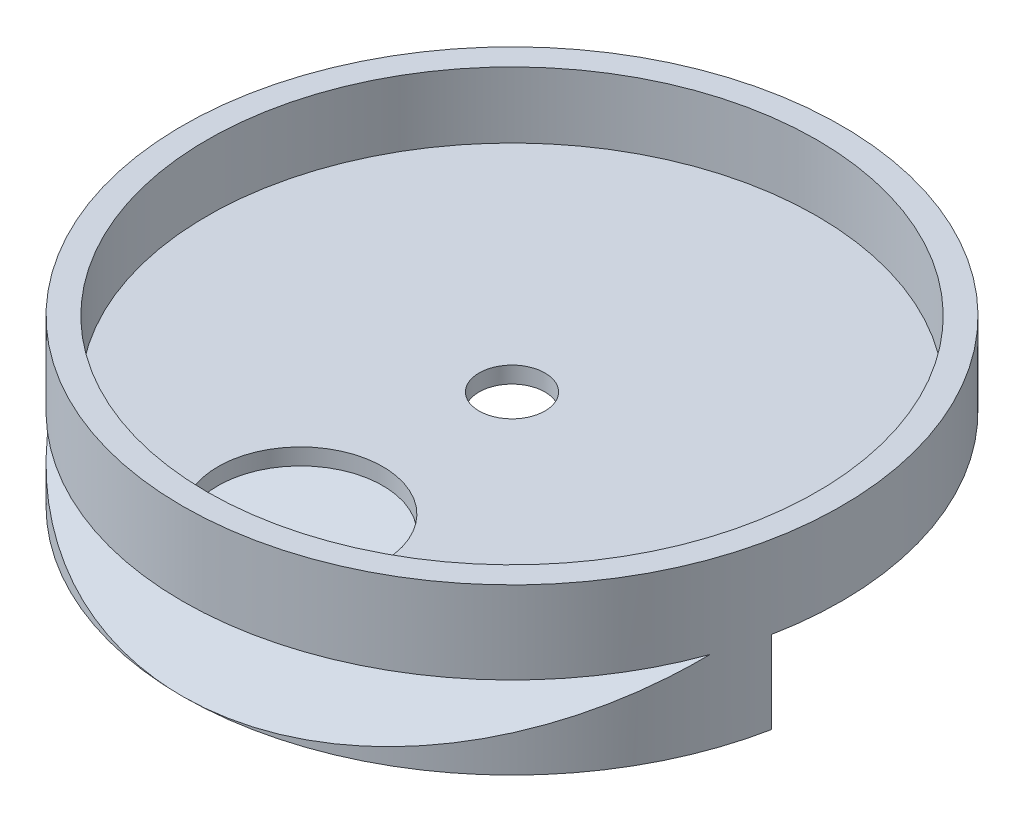
ISO-10303-21;
HEADER;
FILE_DESCRIPTION(('STEP AP214'),'2;1');
FILE_NAME('part.step','',(''),(''),'','','');
FILE_SCHEMA(('AUTOMOTIVE_DESIGN { 1 0 10303 214 1 1 1 1 }'));
ENDSEC;
DATA;
#1=APPLICATION_CONTEXT('core data for automotive mechanical design processes');
#2=APPLICATION_PROTOCOL_DEFINITION('international standard','automotive_design',2000,#1);
#3=PRODUCT_CONTEXT('',#1,'mechanical');
#4=PRODUCT('Part','Part','',(#3));
#5=PRODUCT_RELATED_PRODUCT_CATEGORY('part','',(#4));
#6=PRODUCT_DEFINITION_FORMATION('','',#4);
#7=PRODUCT_DEFINITION_CONTEXT('part definition',#1,'design');
#8=PRODUCT_DEFINITION('design','',#6,#7);
#9=PRODUCT_DEFINITION_SHAPE('','',#8);
#10=(LENGTH_UNIT() NAMED_UNIT(*) SI_UNIT(.MILLI.,.METRE.));
#11=(NAMED_UNIT(*) PLANE_ANGLE_UNIT() SI_UNIT($,.RADIAN.));
#12=(NAMED_UNIT(*) SI_UNIT($,.STERADIAN.) SOLID_ANGLE_UNIT());
#13=UNCERTAINTY_MEASURE_WITH_UNIT(LENGTH_MEASURE(1.E-05),#10,'distance_accuracy_value','');
#14=(GEOMETRIC_REPRESENTATION_CONTEXT(3) GLOBAL_UNCERTAINTY_ASSIGNED_CONTEXT((#13)) GLOBAL_UNIT_ASSIGNED_CONTEXT((#10,
#11,#12)) REPRESENTATION_CONTEXT('',''));
#15=CARTESIAN_POINT('',(0.,0.,0.));
#16=DIRECTION('',(0.,0.,1.));
#17=DIRECTION('',(1.,0.,0.));
#18=AXIS2_PLACEMENT_3D('',#15,#16,#17);
#19=CARTESIAN_POINT('',(0.,12.7,0.));
#20=DIRECTION('',(0.,-1.,0.));
#21=DIRECTION('',(0.,0.,-1.));
#22=AXIS2_PLACEMENT_3D('',#19,#20,#21);
#23=PLANE('',#22);
#24=CARTESIAN_POINT('',(0.,12.7,0.));
#25=DIRECTION('',(0.,-1.,0.));
#26=DIRECTION('',(0.,0.,-1.));
#27=AXIS2_PLACEMENT_3D('',#24,#25,#26);
#28=CIRCLE('',#27,5.08);
#29=CARTESIAN_POINT('',(0.,12.7,-5.08));
#30=VERTEX_POINT('',#29);
#31=EDGE_CURVE('E44',#30,#30,#28,.T.);
#32=ORIENTED_EDGE('',*,*,#31,.F.);
#33=EDGE_LOOP('',(#32));
#34=FACE_BOUND('',#33,.T.);
#35=CARTESIAN_POINT('',(0.,12.7,0.));
#36=DIRECTION('',(0.,-1.,0.));
#37=DIRECTION('',(0.,0.,-1.));
#38=AXIS2_PLACEMENT_3D('',#35,#36,#37);
#39=CIRCLE('',#38,50.8);
#40=CARTESIAN_POINT('',(-49.8418787995032,12.7,9.81973104191904));
#41=VERTEX_POINT('',#40);
#42=CARTESIAN_POINT('',(49.8418787995032,12.7,9.81973104191904));
#43=VERTEX_POINT('',#42);
#44=EDGE_CURVE('E11',#41,#43,#39,.T.);
#45=ORIENTED_EDGE('',*,*,#44,.T.);
#46=DIRECTION('',(1.,0.,0.));
#47=VECTOR('',#46,1.);
#48=CARTESIAN_POINT('',(0.,12.7,9.81973104191904));
#49=LINE('',#48,#47);
#50=CARTESIAN_POINT('',(9.86187581033916,12.7,9.81973104191904));
#51=VERTEX_POINT('',#50);
#52=EDGE_CURVE('E196',#51,#43,#49,.T.);
#53=ORIENTED_EDGE('',*,*,#52,.F.);
#54=DIRECTION('',(0.,0.,-1.));
#55=VECTOR('',#54,1.);
#56=CARTESIAN_POINT('',(9.86187581033916,12.7,0.));
#57=LINE('',#56,#55);
#58=CARTESIAN_POINT('',(9.86187581033916,12.7,16.0571567681165));
#59=VERTEX_POINT('',#58);
#60=EDGE_CURVE('E170',#59,#51,#57,.T.);
#61=ORIENTED_EDGE('',*,*,#60,.F.);
#62=DIRECTION('',(1.,0.,0.));
#63=VECTOR('',#62,1.);
#64=CARTESIAN_POINT('',(0.,12.7,16.0571567681165));
#65=LINE('',#64,#63);
#66=CARTESIAN_POINT('',(-9.86187581033919,12.7,16.0571567681165));
#67=VERTEX_POINT('',#66);
#68=EDGE_CURVE('E164',#67,#59,#65,.T.);
#69=ORIENTED_EDGE('',*,*,#68,.F.);
#70=DIRECTION('',(0.,0.,1.));
#71=VECTOR('',#70,1.);
#72=CARTESIAN_POINT('',(-9.86187581033919,12.7,0.));
#73=LINE('',#72,#71);
#74=CARTESIAN_POINT('',(-9.86187581033919,12.7,9.81973104191904));
#75=VERTEX_POINT('',#74);
#76=EDGE_CURVE('E167',#75,#67,#73,.T.);
#77=ORIENTED_EDGE('',*,*,#76,.F.);
#78=EDGE_CURVE('E192',#41,#75,#49,.T.);
#79=ORIENTED_EDGE('',*,*,#78,.F.);
#80=EDGE_LOOP('',(#45,#53,#61,#69,#77,#79));
#81=FACE_BOUND('',#80,.T.);
#82=DIRECTION('',(0.497498336638125,0.,-0.867464930151241));
#83=VECTOR('',#82,1.);
#84=CARTESIAN_POINT('',(17.5322236628253,12.7,-43.1983876307594));
#85=LINE('',#84,#83);
#86=CARTESIAN_POINT('',(17.5322236628253,12.7,-43.1983876307594));
#87=VERTEX_POINT('',#86);
#88=CARTESIAN_POINT('',(18.4799579941209,12.7,-44.8509083226975));
#89=VERTEX_POINT('',#88);
#90=EDGE_CURVE('E56',#87,#89,#85,.T.);
#91=ORIENTED_EDGE('',*,*,#90,.T.);
#92=CARTESIAN_POINT('',(0.0842895368405178,12.7,-12.7752287109535));
#93=DIRECTION('',(0.,-1.,0.));
#94=DIRECTION('',(1.,0.,0.));
#95=AXIS2_PLACEMENT_3D('',#92,#93,#94);
#96=CIRCLE('',#95,36.9763416327986);
#97=CARTESIAN_POINT('',(-18.3113789204399,12.7,-44.8509083226975));
#98=VERTEX_POINT('',#97);
#99=EDGE_CURVE('E143',#98,#89,#96,.T.);
#100=ORIENTED_EDGE('',*,*,#99,.F.);
#101=DIRECTION('',(0.497498336638125,0.,0.867464930151241));
#102=VECTOR('',#101,1.);
#103=CARTESIAN_POINT('',(-18.3113789204399,12.7,-44.8509083226975));
#104=LINE('',#103,#102);
#105=CARTESIAN_POINT('',(-17.3636445891443,12.7,-43.1983876307594));
#106=VERTEX_POINT('',#105);
#107=EDGE_CURVE('E138',#98,#106,#104,.T.);
#108=ORIENTED_EDGE('',*,*,#107,.T.);
#109=CARTESIAN_POINT('',(0.0842895368405178,12.7,-12.7752287109535));
#110=DIRECTION('',(0.,-1.,0.));
#111=DIRECTION('',(0.,0.,-1.));
#112=AXIS2_PLACEMENT_3D('',#109,#110,#111);
#113=CIRCLE('',#112,35.0713416327986);
#114=EDGE_CURVE('E61',#106,#87,#113,.T.);
#115=ORIENTED_EDGE('',*,*,#114,.T.);
#116=EDGE_LOOP('',(#91,#100,#108,#115));
#117=FACE_BOUND('',#116,.T.);
#118=ADVANCED_FACE('F40',(#34,#81,#117),#23,.T.);
#119=CARTESIAN_POINT('',(0.,0.,0.));
#120=DIRECTION('',(0.,1.,0.));
#121=DIRECTION('',(0.,0.,1.));
#122=AXIS2_PLACEMENT_3D('',#119,#120,#121);
#123=PLANE('',#122);
#124=DIRECTION('',(0.,0.,-1.));
#125=VECTOR('',#124,1.);
#126=CARTESIAN_POINT('',(9.86187581033916,0.,0.));
#127=LINE('',#126,#125);
#128=CARTESIAN_POINT('',(9.86187581033916,0.,16.0571567681165));
#129=VERTEX_POINT('',#128);
#130=CARTESIAN_POINT('',(9.86187581033916,0.,9.81973104191904));
#131=VERTEX_POINT('',#130);
#132=EDGE_CURVE('E168',#129,#131,#127,.T.);
#133=ORIENTED_EDGE('',*,*,#132,.T.);
#134=DIRECTION('',(-1.,0.,0.));
#135=VECTOR('',#134,1.);
#136=CARTESIAN_POINT('',(0.,0.,9.81973104191904));
#137=LINE('',#136,#135);
#138=CARTESIAN_POINT('',(49.8418787995032,0.,9.81973104191904));
#139=VERTEX_POINT('',#138);
#140=EDGE_CURVE('E49',#139,#131,#137,.T.);
#141=ORIENTED_EDGE('',*,*,#140,.F.);
#142=CARTESIAN_POINT('',(0.,0.,0.));
#143=DIRECTION('',(0.,1.,0.));
#144=DIRECTION('',(0.,0.,1.));
#145=AXIS2_PLACEMENT_3D('',#142,#143,#144);
#146=CIRCLE('',#145,50.8);
#147=CARTESIAN_POINT('',(0.,0.,50.8));
#148=VERTEX_POINT('',#147);
#149=EDGE_CURVE('E222',#148,#139,#146,.T.);
#150=ORIENTED_EDGE('',*,*,#149,.F.);
#151=CARTESIAN_POINT('',(-49.8418787995032,0.,9.81973104191904));
#152=VERTEX_POINT('',#151);
#153=EDGE_CURVE('E226',#152,#148,#146,.T.);
#154=ORIENTED_EDGE('',*,*,#153,.F.);
#155=CARTESIAN_POINT('',(-9.86187581033919,0.,9.81973104191904));
#156=VERTEX_POINT('',#155);
#157=EDGE_CURVE('E229',#156,#152,#137,.T.);
#158=ORIENTED_EDGE('',*,*,#157,.F.);
#159=DIRECTION('',(0.,0.,1.));
#160=VECTOR('',#159,1.);
#161=CARTESIAN_POINT('',(-9.86187581033919,0.,0.));
#162=LINE('',#161,#160);
#163=CARTESIAN_POINT('',(-9.86187581033919,0.,16.0571567681165));
#164=VERTEX_POINT('',#163);
#165=EDGE_CURVE('E175',#156,#164,#162,.T.);
#166=ORIENTED_EDGE('',*,*,#165,.T.);
#167=DIRECTION('',(1.,0.,0.));
#168=VECTOR('',#167,1.);
#169=CARTESIAN_POINT('',(0.,0.,16.0571567681165));
#170=LINE('',#169,#168);
#171=EDGE_CURVE('E145',#164,#129,#170,.T.);
#172=ORIENTED_EDGE('',*,*,#171,.T.);
#173=EDGE_LOOP('',(#133,#141,#150,#154,#158,#166,#172));
#174=FACE_BOUND('',#173,.T.);
#175=ADVANCED_FACE('F247',(#174),#123,.F.);
#176=CARTESIAN_POINT('',(0.,12.7,9.81973104191904));
#177=DIRECTION('',(0.,0.,-1.));
#178=DIRECTION('',(-1.,0.,0.));
#179=AXIS2_PLACEMENT_3D('',#176,#177,#178);
#180=PLANE('',#179);
#181=ORIENTED_EDGE('',*,*,#140,.T.);
#182=DIRECTION('',(0.,-1.,0.));
#183=VECTOR('',#182,1.);
#184=CARTESIAN_POINT('',(9.86187581033916,12.7,9.81973104191904));
#185=LINE('',#184,#183);
#186=EDGE_CURVE('E184',#51,#131,#185,.T.);
#187=ORIENTED_EDGE('',*,*,#186,.F.);
#188=ORIENTED_EDGE('',*,*,#52,.T.);
#189=DIRECTION('',(0.,-1.,0.));
#190=VECTOR('',#189,1.);
#191=CARTESIAN_POINT('',(49.8418787995032,12.7,9.81973104191904));
#192=LINE('',#191,#190);
#193=EDGE_CURVE('E198',#43,#139,#192,.T.);
#194=ORIENTED_EDGE('',*,*,#193,.T.);
#195=EDGE_LOOP('',(#181,#187,#188,#194));
#196=FACE_BOUND('',#195,.T.);
#197=ADVANCED_FACE('F273',(#196),#180,.T.);
#198=ORIENTED_EDGE('',*,*,#78,.T.);
#199=DIRECTION('',(0.,-1.,0.));
#200=VECTOR('',#199,1.);
#201=CARTESIAN_POINT('',(-9.86187581033919,12.7,9.81973104191904));
#202=LINE('',#201,#200);
#203=EDGE_CURVE('E186',#75,#156,#202,.T.);
#204=ORIENTED_EDGE('',*,*,#203,.T.);
#205=ORIENTED_EDGE('',*,*,#157,.T.);
#206=DIRECTION('',(0.,-1.,0.));
#207=VECTOR('',#206,1.);
#208=CARTESIAN_POINT('',(-49.8418787995032,12.7,9.81973104191904));
#209=LINE('',#208,#207);
#210=EDGE_CURVE('E195',#152,#41,#209,.F.);
#211=ORIENTED_EDGE('',*,*,#210,.T.);
#212=EDGE_LOOP('',(#198,#204,#205,#211));
#213=FACE_BOUND('',#212,.T.);
#214=ADVANCED_FACE('F237',(#213),#180,.T.);
#215=CARTESIAN_POINT('',(0.,12.7,0.));
#216=DIRECTION('',(0.,-1.,0.));
#217=DIRECTION('',(0.,0.,-1.));
#218=AXIS2_PLACEMENT_3D('',#215,#216,#217);
#219=CYLINDRICAL_SURFACE('',#218,50.8);
#220=CARTESIAN_POINT('',(0.,25.4,0.));
#221=DIRECTION('',(0.,1.,0.));
#222=DIRECTION('',(0.,0.,1.));
#223=AXIS2_PLACEMENT_3D('',#220,#221,#222);
#224=CIRCLE('',#223,50.8);
#225=CARTESIAN_POINT('',(0.,25.4,50.8));
#226=VERTEX_POINT('',#225);
#227=EDGE_CURVE('E209',#226,#226,#224,.T.);
#228=ORIENTED_EDGE('',*,*,#227,.F.);
#229=EDGE_LOOP('',(#228));
#230=FACE_BOUND('',#229,.T.);
#231=ORIENTED_EDGE('',*,*,#193,.F.);
#232=ORIENTED_EDGE('',*,*,#44,.F.);
#233=ORIENTED_EDGE('',*,*,#210,.F.);
#234=ORIENTED_EDGE('',*,*,#153,.T.);
#235=CARTESIAN_POINT('',(0.,19.2356534045222,0.));
#236=DIRECTION('',(0.,0.935200729512872,0.354118053082007));
#237=DIRECTION('',(0.,-0.354118053082007,0.935200729512873));
#238=AXIS2_PLACEMENT_3D('',#235,#236,#237);
#239=ELLIPSE('',#238,54.3198891926236,50.8);
#240=CARTESIAN_POINT('',(-47.7778772371175,12.7,17.2601983393854));
#241=VERTEX_POINT('',#240);
#242=EDGE_CURVE('E218',#241,#148,#239,.T.);
#243=ORIENTED_EDGE('',*,*,#242,.F.);
#244=CARTESIAN_POINT('',(0.,12.7,0.));
#245=DIRECTION('',(0.,1.,0.));
#246=DIRECTION('',(0.,0.,1.));
#247=AXIS2_PLACEMENT_3D('',#244,#245,#246);
#248=CIRCLE('',#247,50.8);
#249=CARTESIAN_POINT('',(47.7778772371176,12.7,17.2601983393854));
#250=VERTEX_POINT('',#249);
#251=EDGE_CURVE('E212',#241,#250,#248,.T.);
#252=ORIENTED_EDGE('',*,*,#251,.T.);
#253=EDGE_CURVE('E221',#148,#250,#239,.T.);
#254=ORIENTED_EDGE('',*,*,#253,.F.);
#255=ORIENTED_EDGE('',*,*,#149,.T.);
#256=EDGE_LOOP('',(#231,#232,#233,#234,#243,#252,#254,#255));
#257=FACE_BOUND('',#256,.T.);
#258=ADVANCED_FACE('F42',(#230,#257),#219,.T.);
#259=CARTESIAN_POINT('',(77.978,0.,50.8));
#260=DIRECTION('',(0.,0.935200729512872,0.354118053082007));
#261=DIRECTION('',(0.,-0.354118053082007,0.935200729512873));
#262=AXIS2_PLACEMENT_3D('',#259,#260,#261);
#263=PLANE('',#262);
#264=ORIENTED_EDGE('',*,*,#253,.T.);
#265=DIRECTION('',(-1.,0.,0.));
#266=VECTOR('',#265,1.);
#267=CARTESIAN_POINT('',(77.978,12.7,17.2601983393854));
#268=LINE('',#267,#266);
#269=EDGE_CURVE('E215',#250,#241,#268,.T.);
#270=ORIENTED_EDGE('',*,*,#269,.T.);
#271=ORIENTED_EDGE('',*,*,#242,.T.);
#272=EDGE_LOOP('',(#264,#270,#271));
#273=FACE_BOUND('',#272,.T.);
#274=ADVANCED_FACE('F251',(#273),#263,.T.);
#275=CARTESIAN_POINT('',(0.,12.7,0.));
#276=DIRECTION('',(0.,1.,0.));
#277=DIRECTION('',(0.,0.,1.));
#278=AXIS2_PLACEMENT_3D('',#275,#276,#277);
#279=PLANE('',#278);
#280=CARTESIAN_POINT('',(0.,12.7,32.6201898621607));
#281=DIRECTION('',(0.,1.,0.));
#282=DIRECTION('',(0.,0.,1.));
#283=AXIS2_PLACEMENT_3D('',#280,#281,#282);
#284=CIRCLE('',#283,12.7);
#285=CARTESIAN_POINT('',(0.,12.7,45.3201898621607));
#286=VERTEX_POINT('',#285);
#287=EDGE_CURVE('E201',#286,#286,#284,.T.);
#288=ORIENTED_EDGE('',*,*,#287,.T.);
#289=EDGE_LOOP('',(#288));
#290=FACE_BOUND('',#289,.T.);
#291=ORIENTED_EDGE('',*,*,#269,.F.);
#292=ORIENTED_EDGE('',*,*,#251,.F.);
#293=EDGE_LOOP('',(#291,#292));
#294=FACE_BOUND('',#293,.T.);
#295=ADVANCED_FACE('F253',(#290,#294),#279,.F.);
#296=CARTESIAN_POINT('',(0.,25.4,0.));
#297=DIRECTION('',(0.,-1.,0.));
#298=DIRECTION('',(0.,0.,-1.));
#299=AXIS2_PLACEMENT_3D('',#296,#297,#298);
#300=CYLINDRICAL_SURFACE('',#299,47.0068358423163);
#301=CARTESIAN_POINT('',(0.,25.4,0.));
#302=DIRECTION('',(0.,1.,0.));
#303=DIRECTION('',(0.,0.,1.));
#304=AXIS2_PLACEMENT_3D('',#301,#302,#303);
#305=CIRCLE('',#304,47.0068358423163);
#306=CARTESIAN_POINT('',(0.,25.4,47.0068358423163));
#307=VERTEX_POINT('',#306);
#308=EDGE_CURVE('E204',#307,#307,#305,.T.);
#309=ORIENTED_EDGE('',*,*,#308,.T.);
#310=EDGE_LOOP('',(#309));
#311=FACE_BOUND('',#310,.T.);
#312=CARTESIAN_POINT('',(0.,15.24,0.));
#313=DIRECTION('',(0.,1.,0.));
#314=DIRECTION('',(0.,0.,1.));
#315=AXIS2_PLACEMENT_3D('',#312,#313,#314);
#316=CIRCLE('',#315,47.0068358423163);
#317=CARTESIAN_POINT('',(0.,15.24,47.0068358423163));
#318=VERTEX_POINT('',#317);
#319=EDGE_CURVE('E225',#318,#318,#316,.F.);
#320=ORIENTED_EDGE('',*,*,#319,.T.);
#321=EDGE_LOOP('',(#320));
#322=FACE_BOUND('',#321,.T.);
#323=ADVANCED_FACE('F255',(#311,#322),#300,.F.);
#324=CARTESIAN_POINT('',(0.,25.4,0.));
#325=DIRECTION('',(0.,1.,0.));
#326=DIRECTION('',(0.,0.,1.));
#327=AXIS2_PLACEMENT_3D('',#324,#325,#326);
#328=PLANE('',#327);
#329=ORIENTED_EDGE('',*,*,#308,.F.);
#330=EDGE_LOOP('',(#329));
#331=FACE_BOUND('',#330,.T.);
#332=ORIENTED_EDGE('',*,*,#227,.T.);
#333=EDGE_LOOP('',(#332));
#334=FACE_BOUND('',#333,.T.);
#335=ADVANCED_FACE('F262',(#331,#334),#328,.T.);
#336=CARTESIAN_POINT('',(0.,15.24,0.));
#337=DIRECTION('',(0.,1.,0.));
#338=DIRECTION('',(0.,0.,1.));
#339=AXIS2_PLACEMENT_3D('',#336,#337,#338);
#340=PLANE('',#339);
#341=CARTESIAN_POINT('',(0.,15.24,0.));
#342=DIRECTION('',(0.,1.,0.));
#343=DIRECTION('',(0.,0.,1.));
#344=AXIS2_PLACEMENT_3D('',#341,#342,#343);
#345=CIRCLE('',#344,5.08);
#346=CARTESIAN_POINT('',(0.,15.24,5.08));
#347=VERTEX_POINT('',#346);
#348=EDGE_CURVE('E183',#347,#347,#345,.T.);
#349=ORIENTED_EDGE('',*,*,#348,.F.);
#350=EDGE_LOOP('',(#349));
#351=FACE_BOUND('',#350,.T.);
#352=CARTESIAN_POINT('',(0.,15.24,32.6201898621607));
#353=DIRECTION('',(0.,1.,0.));
#354=DIRECTION('',(0.,0.,1.));
#355=AXIS2_PLACEMENT_3D('',#352,#353,#354);
#356=CIRCLE('',#355,12.7);
#357=CARTESIAN_POINT('',(0.,15.24,45.3201898621607));
#358=VERTEX_POINT('',#357);
#359=EDGE_CURVE('E200',#358,#358,#356,.T.);
#360=ORIENTED_EDGE('',*,*,#359,.F.);
#361=EDGE_LOOP('',(#360));
#362=FACE_BOUND('',#361,.T.);
#363=ORIENTED_EDGE('',*,*,#319,.F.);
#364=EDGE_LOOP('',(#363));
#365=FACE_BOUND('',#364,.T.);
#366=ADVANCED_FACE('F285',(#351,#362,#365),#340,.T.);
#367=CARTESIAN_POINT('',(0.,12.7,32.6201898621607));
#368=DIRECTION('',(0.,1.,0.));
#369=DIRECTION('',(0.,0.,1.));
#370=AXIS2_PLACEMENT_3D('',#367,#368,#369);
#371=CYLINDRICAL_SURFACE('',#370,12.7);
#372=ORIENTED_EDGE('',*,*,#287,.F.);
#373=EDGE_LOOP('',(#372));
#374=FACE_BOUND('',#373,.T.);
#375=ORIENTED_EDGE('',*,*,#359,.T.);
#376=EDGE_LOOP('',(#375));
#377=FACE_BOUND('',#376,.T.);
#378=ADVANCED_FACE('F282',(#374,#377),#371,.F.);
#379=CARTESIAN_POINT('',(0.,2.54,0.));
#380=DIRECTION('',(0.,1.,0.));
#381=DIRECTION('',(0.,0.,1.));
#382=AXIS2_PLACEMENT_3D('',#379,#380,#381);
#383=CYLINDRICAL_SURFACE('',#382,5.08);
#384=ORIENTED_EDGE('',*,*,#31,.T.);
#385=EDGE_LOOP('',(#384));
#386=FACE_BOUND('',#385,.T.);
#387=ORIENTED_EDGE('',*,*,#348,.T.);
#388=EDGE_LOOP('',(#387));
#389=FACE_BOUND('',#388,.T.);
#390=ADVANCED_FACE('F278',(#386,#389),#383,.F.);
#391=CARTESIAN_POINT('',(0.,12.7,16.0571567681165));
#392=DIRECTION('',(0.,0.,-1.));
#393=DIRECTION('',(-1.,0.,0.));
#394=AXIS2_PLACEMENT_3D('',#391,#392,#393);
#395=PLANE('',#394);
#396=ORIENTED_EDGE('',*,*,#171,.F.);
#397=DIRECTION('',(0.,-1.,0.));
#398=VECTOR('',#397,1.);
#399=CARTESIAN_POINT('',(-9.86187581033919,12.7,16.0571567681165));
#400=LINE('',#399,#398);
#401=EDGE_CURVE('E172',#67,#164,#400,.T.);
#402=ORIENTED_EDGE('',*,*,#401,.F.);
#403=ORIENTED_EDGE('',*,*,#68,.T.);
#404=DIRECTION('',(0.,-1.,0.));
#405=VECTOR('',#404,1.);
#406=CARTESIAN_POINT('',(9.86187581033916,12.7,16.0571567681165));
#407=LINE('',#406,#405);
#408=EDGE_CURVE('E180',#59,#129,#407,.T.);
#409=ORIENTED_EDGE('',*,*,#408,.T.);
#410=EDGE_LOOP('',(#396,#402,#403,#409));
#411=FACE_BOUND('',#410,.T.);
#412=ADVANCED_FACE('F302',(#411),#395,.T.);
#413=CARTESIAN_POINT('',(9.86187581033916,12.7,0.));
#414=DIRECTION('',(-1.,0.,0.));
#415=DIRECTION('',(0.,0.,1.));
#416=AXIS2_PLACEMENT_3D('',#413,#414,#415);
#417=PLANE('',#416);
#418=ORIENTED_EDGE('',*,*,#132,.F.);
#419=ORIENTED_EDGE('',*,*,#408,.F.);
#420=ORIENTED_EDGE('',*,*,#60,.T.);
#421=ORIENTED_EDGE('',*,*,#186,.T.);
#422=EDGE_LOOP('',(#418,#419,#420,#421));
#423=FACE_BOUND('',#422,.T.);
#424=ADVANCED_FACE('F307',(#423),#417,.T.);
#425=CARTESIAN_POINT('',(-9.86187581033919,12.7,0.));
#426=DIRECTION('',(1.,0.,0.));
#427=DIRECTION('',(0.,0.,-1.));
#428=AXIS2_PLACEMENT_3D('',#425,#426,#427);
#429=PLANE('',#428);
#430=ORIENTED_EDGE('',*,*,#165,.F.);
#431=ORIENTED_EDGE('',*,*,#203,.F.);
#432=ORIENTED_EDGE('',*,*,#76,.T.);
#433=ORIENTED_EDGE('',*,*,#401,.T.);
#434=EDGE_LOOP('',(#430,#431,#432,#433));
#435=FACE_BOUND('',#434,.T.);
#436=ADVANCED_FACE('F314',(#435),#429,.T.);
#437=CARTESIAN_POINT('',(0.0842895368405178,0.,-12.7752287109535));
#438=DIRECTION('',(0.,1.,0.));
#439=DIRECTION('',(0.,0.,1.));
#440=AXIS2_PLACEMENT_3D('',#437,#438,#439);
#441=CYLINDRICAL_SURFACE('',#440,36.9763416327986);
#442=ORIENTED_EDGE('',*,*,#99,.T.);
#443=DIRECTION('',(0.,1.,0.));
#444=VECTOR('',#443,1.);
#445=CARTESIAN_POINT('',(18.4799579941209,0.,-44.8509083226975));
#446=LINE('',#445,#444);
#447=CARTESIAN_POINT('',(18.4799579941209,0.,-44.8509083226975));
#448=VERTEX_POINT('',#447);
#449=EDGE_CURVE('E141',#448,#89,#446,.T.);
#450=ORIENTED_EDGE('',*,*,#449,.F.);
#451=CARTESIAN_POINT('',(0.0842895368405178,0.,-12.7752287109535));
#452=DIRECTION('',(0.,-1.,0.));
#453=DIRECTION('',(1.,0.,0.));
#454=AXIS2_PLACEMENT_3D('',#451,#452,#453);
#455=CIRCLE('',#454,36.9763416327986);
#456=CARTESIAN_POINT('',(-18.3113789204399,0.,-44.8509083226975));
#457=VERTEX_POINT('',#456);
#458=EDGE_CURVE('E127',#457,#448,#455,.T.);
#459=ORIENTED_EDGE('',*,*,#458,.F.);
#460=DIRECTION('',(0.,1.,0.));
#461=VECTOR('',#460,1.);
#462=CARTESIAN_POINT('',(-18.3113789204399,0.,-44.8509083226975));
#463=LINE('',#462,#461);
#464=EDGE_CURVE('E154',#457,#98,#463,.T.);
#465=ORIENTED_EDGE('',*,*,#464,.T.);
#466=EDGE_LOOP('',(#442,#450,#459,#465));
#467=FACE_BOUND('',#466,.T.);
#468=ADVANCED_FACE('F142',(#467),#441,.T.);
#469=CARTESIAN_POINT('',(17.5322236628253,0.,-43.1983876307594));
#470=DIRECTION('',(0.867464930151242,0.,0.497498336638125));
#471=DIRECTION('',(0.497498336638125,0.,-0.867464930151242));
#472=AXIS2_PLACEMENT_3D('',#469,#470,#471);
#473=PLANE('',#472);
#474=ORIENTED_EDGE('',*,*,#90,.F.);
#475=DIRECTION('',(0.,1.,0.));
#476=VECTOR('',#475,1.);
#477=CARTESIAN_POINT('',(17.5322236628253,0.,-43.1983876307594));
#478=LINE('',#477,#476);
#479=CARTESIAN_POINT('',(17.5322236628253,0.,-43.1983876307594));
#480=VERTEX_POINT('',#479);
#481=EDGE_CURVE('E146',#480,#87,#478,.T.);
#482=ORIENTED_EDGE('',*,*,#481,.F.);
#483=DIRECTION('',(0.497498336638125,0.,-0.867464930151241));
#484=VECTOR('',#483,1.);
#485=CARTESIAN_POINT('',(17.5322236628253,0.,-43.1983876307594));
#486=LINE('',#485,#484);
#487=EDGE_CURVE('E132',#480,#448,#486,.T.);
#488=ORIENTED_EDGE('',*,*,#487,.T.);
#489=ORIENTED_EDGE('',*,*,#449,.T.);
#490=EDGE_LOOP('',(#474,#482,#488,#489));
#491=FACE_BOUND('',#490,.T.);
#492=ADVANCED_FACE('F148',(#491),#473,.T.);
#493=CARTESIAN_POINT('',(0.0842895368405178,0.,-12.7752287109535));
#494=DIRECTION('',(0.,1.,0.));
#495=DIRECTION('',(0.,0.,1.));
#496=AXIS2_PLACEMENT_3D('',#493,#494,#495);
#497=CYLINDRICAL_SURFACE('',#496,35.0713416327986);
#498=ORIENTED_EDGE('',*,*,#114,.F.);
#499=DIRECTION('',(0.,1.,0.));
#500=VECTOR('',#499,1.);
#501=CARTESIAN_POINT('',(-17.3636445891443,0.,-43.1983876307594));
#502=LINE('',#501,#500);
#503=CARTESIAN_POINT('',(-17.3636445891443,0.,-43.1983876307594));
#504=VERTEX_POINT('',#503);
#505=EDGE_CURVE('E160',#504,#106,#502,.T.);
#506=ORIENTED_EDGE('',*,*,#505,.F.);
#507=CARTESIAN_POINT('',(0.0842895368405178,0.,-12.7752287109535));
#508=DIRECTION('',(0.,-1.,0.));
#509=DIRECTION('',(0.,0.,-1.));
#510=AXIS2_PLACEMENT_3D('',#507,#508,#509);
#511=CIRCLE('',#510,35.0713416327986);
#512=EDGE_CURVE('E149',#504,#480,#511,.T.);
#513=ORIENTED_EDGE('',*,*,#512,.T.);
#514=ORIENTED_EDGE('',*,*,#481,.T.);
#515=EDGE_LOOP('',(#498,#506,#513,#514));
#516=FACE_BOUND('',#515,.T.);
#517=ADVANCED_FACE('F329',(#516),#497,.F.);
#518=CARTESIAN_POINT('',(-18.3113789204399,0.,-44.8509083226975));
#519=DIRECTION('',(-0.867464930151242,0.,0.497498336638125));
#520=DIRECTION('',(0.497498336638125,0.,0.867464930151242));
#521=AXIS2_PLACEMENT_3D('',#518,#519,#520);
#522=PLANE('',#521);
#523=ORIENTED_EDGE('',*,*,#107,.F.);
#524=ORIENTED_EDGE('',*,*,#464,.F.);
#525=DIRECTION('',(0.497498336638125,0.,0.867464930151241));
#526=VECTOR('',#525,1.);
#527=CARTESIAN_POINT('',(-18.3113789204399,0.,-44.8509083226975));
#528=LINE('',#527,#526);
#529=EDGE_CURVE('E135',#457,#504,#528,.T.);
#530=ORIENTED_EDGE('',*,*,#529,.T.);
#531=ORIENTED_EDGE('',*,*,#505,.T.);
#532=EDGE_LOOP('',(#523,#524,#530,#531));
#533=FACE_BOUND('',#532,.T.);
#534=ADVANCED_FACE('F332',(#533),#522,.T.);
#535=CARTESIAN_POINT('',(0.0842895368405178,0.,-12.7752287109535));
#536=DIRECTION('',(0.,-1.,0.));
#537=DIRECTION('',(1.,0.,0.));
#538=AXIS2_PLACEMENT_3D('',#535,#536,#537);
#539=PLANE('',#538);
#540=ORIENTED_EDGE('',*,*,#458,.T.);
#541=ORIENTED_EDGE('',*,*,#487,.F.);
#542=ORIENTED_EDGE('',*,*,#512,.F.);
#543=ORIENTED_EDGE('',*,*,#529,.F.);
#544=EDGE_LOOP('',(#540,#541,#542,#543));
#545=FACE_BOUND('',#544,.T.);
#546=ADVANCED_FACE('F129',(#545),#539,.T.);
#547=CLOSED_SHELL('',(#118,#175,#197,#214,#258,#274,#295,#323,#335,#366,#378,#390,#412,#424,
#436,#468,#492,#517,#534,#546));
#548=MANIFOLD_SOLID_BREP('B2',#547);
#549=ADVANCED_BREP_SHAPE_REPRESENTATION('',(#18,#548),#14);
#550=SHAPE_DEFINITION_REPRESENTATION(#9,#549);
ENDSEC;
END-ISO-10303-21;
